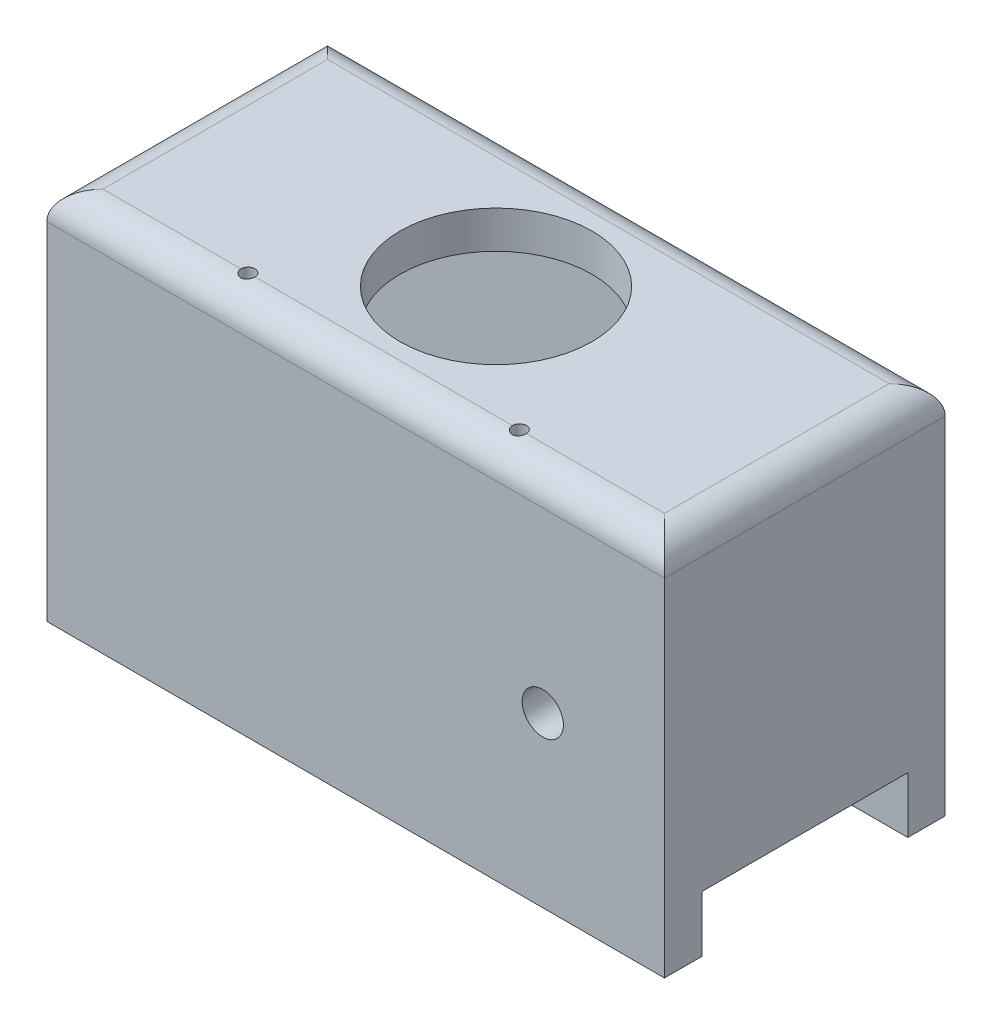
ISO-10303-21;
HEADER;
FILE_DESCRIPTION(('STEP AP214'),'2;1');
FILE_NAME('part.step','',(''),(''),'','','');
FILE_SCHEMA(('AUTOMOTIVE_DESIGN { 1 0 10303 214 1 1 1 1 }'));
ENDSEC;
DATA;
#1=APPLICATION_CONTEXT('core data for automotive mechanical design processes');
#2=APPLICATION_PROTOCOL_DEFINITION('international standard','automotive_design',2000,#1);
#3=PRODUCT_CONTEXT('',#1,'mechanical');
#4=PRODUCT('Part','Part','',(#3));
#5=PRODUCT_RELATED_PRODUCT_CATEGORY('part','',(#4));
#6=PRODUCT_DEFINITION_FORMATION('','',#4);
#7=PRODUCT_DEFINITION_CONTEXT('part definition',#1,'design');
#8=PRODUCT_DEFINITION('design','',#6,#7);
#9=PRODUCT_DEFINITION_SHAPE('','',#8);
#10=(LENGTH_UNIT() NAMED_UNIT(*) SI_UNIT(.MILLI.,.METRE.));
#11=(NAMED_UNIT(*) PLANE_ANGLE_UNIT() SI_UNIT($,.RADIAN.));
#12=(NAMED_UNIT(*) SI_UNIT($,.STERADIAN.) SOLID_ANGLE_UNIT());
#13=UNCERTAINTY_MEASURE_WITH_UNIT(LENGTH_MEASURE(1.E-05),#10,'distance_accuracy_value','');
#14=(GEOMETRIC_REPRESENTATION_CONTEXT(3) GLOBAL_UNCERTAINTY_ASSIGNED_CONTEXT((#13)) GLOBAL_UNIT_ASSIGNED_CONTEXT((#10,
#11,#12)) REPRESENTATION_CONTEXT('',''));
#15=CARTESIAN_POINT('',(0.,0.,0.));
#16=DIRECTION('',(0.,0.,1.));
#17=DIRECTION('',(1.,0.,0.));
#18=AXIS2_PLACEMENT_3D('',#15,#16,#17);
#19=CARTESIAN_POINT('',(0.,-30.,0.));
#20=DIRECTION('',(0.,-1.,0.));
#21=DIRECTION('',(0.,0.,-1.));
#22=AXIS2_PLACEMENT_3D('',#19,#20,#21);
#23=PLANE('',#22);
#24=DIRECTION('',(1.,0.,0.));
#25=VECTOR('',#24,1.);
#26=CARTESIAN_POINT('',(0.,-30.,26.));
#27=LINE('',#26,#25);
#28=CARTESIAN_POINT('',(-66.,-30.,26.));
#29=VERTEX_POINT('',#28);
#30=CARTESIAN_POINT('',(-62.,-30.,26.));
#31=VERTEX_POINT('',#30);
#32=EDGE_CURVE('E51',#29,#31,#27,.T.);
#33=ORIENTED_EDGE('',*,*,#32,.F.);
#34=DIRECTION('',(0.,0.,-1.));
#35=VECTOR('',#34,1.);
#36=CARTESIAN_POINT('',(-66.,-30.,30.));
#37=LINE('',#36,#35);
#38=CARTESIAN_POINT('',(-66.,-30.,4.));
#39=VERTEX_POINT('',#38);
#40=EDGE_CURVE('E439',#29,#39,#37,.T.);
#41=ORIENTED_EDGE('',*,*,#40,.T.);
#42=DIRECTION('',(-1.,0.,0.));
#43=VECTOR('',#42,1.);
#44=CARTESIAN_POINT('',(-66.,-30.,4.));
#45=LINE('',#44,#43);
#46=CARTESIAN_POINT('',(-62.,-30.,4.));
#47=VERTEX_POINT('',#46);
#48=EDGE_CURVE('E49',#47,#39,#45,.T.);
#49=ORIENTED_EDGE('',*,*,#48,.F.);
#50=DIRECTION('',(0.,0.,-1.));
#51=VECTOR('',#50,1.);
#52=CARTESIAN_POINT('',(-62.,-30.,26.));
#53=LINE('',#52,#51);
#54=EDGE_CURVE('E431',#31,#47,#53,.T.);
#55=ORIENTED_EDGE('',*,*,#54,.F.);
#56=EDGE_LOOP('',(#33,#41,#49,#55));
#57=FACE_BOUND('',#56,.T.);
#58=ADVANCED_FACE('F39',(#57),#23,.T.);
#59=CARTESIAN_POINT('',(0.,4.,0.));
#60=DIRECTION('',(-1.,0.,0.));
#61=DIRECTION('',(0.,0.,1.));
#62=AXIS2_PLACEMENT_3D('',#59,#60,#61);
#63=PLANE('',#62);
#64=DIRECTION('',(0.,-1.,0.));
#65=VECTOR('',#64,1.);
#66=CARTESIAN_POINT('',(0.,4.,0.));
#67=LINE('',#66,#65);
#68=CARTESIAN_POINT('',(0.,1.,0.));
#69=VERTEX_POINT('',#68);
#70=CARTESIAN_POINT('',(0.,-36.,0.));
#71=VERTEX_POINT('',#70);
#72=EDGE_CURVE('E445',#69,#71,#67,.T.);
#73=ORIENTED_EDGE('',*,*,#72,.F.);
#74=DIRECTION('',(0.,0.,-1.));
#75=VECTOR('',#74,1.);
#76=CARTESIAN_POINT('',(0.,1.,0.));
#77=LINE('',#76,#75);
#78=CARTESIAN_POINT('',(0.,1.,30.));
#79=VERTEX_POINT('',#78);
#80=EDGE_CURVE('E165',#69,#79,#77,.F.);
#81=ORIENTED_EDGE('',*,*,#80,.T.);
#82=DIRECTION('',(0.,-1.,0.));
#83=VECTOR('',#82,1.);
#84=CARTESIAN_POINT('',(0.,4.,30.));
#85=LINE('',#84,#83);
#86=CARTESIAN_POINT('',(0.,-36.,30.));
#87=VERTEX_POINT('',#86);
#88=EDGE_CURVE('E157',#79,#87,#85,.T.);
#89=ORIENTED_EDGE('',*,*,#88,.T.);
#90=DIRECTION('',(0.,0.,1.));
#91=VECTOR('',#90,1.);
#92=CARTESIAN_POINT('',(0.,-36.,30.));
#93=LINE('',#92,#91);
#94=CARTESIAN_POINT('',(0.,-36.,26.));
#95=VERTEX_POINT('',#94);
#96=EDGE_CURVE('E163',#95,#87,#93,.T.);
#97=ORIENTED_EDGE('',*,*,#96,.F.);
#98=DIRECTION('',(0.,1.,0.));
#99=VECTOR('',#98,1.);
#100=CARTESIAN_POINT('',(0.,-36.,26.));
#101=LINE('',#100,#99);
#102=CARTESIAN_POINT('',(0.,-30.,26.));
#103=VERTEX_POINT('',#102);
#104=EDGE_CURVE('E188',#95,#103,#101,.T.);
#105=ORIENTED_EDGE('',*,*,#104,.T.);
#106=DIRECTION('',(0.,0.,1.));
#107=VECTOR('',#106,1.);
#108=CARTESIAN_POINT('',(0.,-30.,0.));
#109=LINE('',#108,#107);
#110=CARTESIAN_POINT('',(0.,-30.,4.));
#111=VERTEX_POINT('',#110);
#112=EDGE_CURVE('E437',#111,#103,#109,.T.);
#113=ORIENTED_EDGE('',*,*,#112,.F.);
#114=DIRECTION('',(0.,1.,0.));
#115=VECTOR('',#114,1.);
#116=CARTESIAN_POINT('',(0.,-36.,4.));
#117=LINE('',#116,#115);
#118=CARTESIAN_POINT('',(0.,-36.,4.));
#119=VERTEX_POINT('',#118);
#120=EDGE_CURVE('E195',#119,#111,#117,.T.);
#121=ORIENTED_EDGE('',*,*,#120,.F.);
#122=DIRECTION('',(0.,0.,1.));
#123=VECTOR('',#122,1.);
#124=CARTESIAN_POINT('',(0.,-36.,0.));
#125=LINE('',#124,#123);
#126=EDGE_CURVE('E203',#71,#119,#125,.T.);
#127=ORIENTED_EDGE('',*,*,#126,.F.);
#128=EDGE_LOOP('',(#73,#81,#89,#97,#105,#113,#121,#127));
#129=FACE_BOUND('',#128,.T.);
#130=ADVANCED_FACE('F160',(#129),#63,.F.);
#131=CARTESIAN_POINT('',(0.,4.,0.));
#132=DIRECTION('',(0.,0.,1.));
#133=DIRECTION('',(1.,0.,0.));
#134=AXIS2_PLACEMENT_3D('',#131,#132,#133);
#135=PLANE('',#134);
#136=DIRECTION('',(0.,-1.,0.));
#137=VECTOR('',#136,1.);
#138=CARTESIAN_POINT('',(-66.,4.,0.));
#139=LINE('',#138,#137);
#140=CARTESIAN_POINT('',(-66.,1.,0.));
#141=VERTEX_POINT('',#140);
#142=CARTESIAN_POINT('',(-66.,-36.,0.));
#143=VERTEX_POINT('',#142);
#144=EDGE_CURVE('E443',#141,#143,#139,.T.);
#145=ORIENTED_EDGE('',*,*,#144,.F.);
#146=DIRECTION('',(-1.,0.,0.));
#147=VECTOR('',#146,1.);
#148=CARTESIAN_POINT('',(0.,1.,0.));
#149=LINE('',#148,#147);
#150=EDGE_CURVE('E459',#141,#69,#149,.F.);
#151=ORIENTED_EDGE('',*,*,#150,.T.);
#152=ORIENTED_EDGE('',*,*,#72,.T.);
#153=DIRECTION('',(1.,0.,0.));
#154=VECTOR('',#153,1.);
#155=CARTESIAN_POINT('',(-66.,-36.,0.));
#156=LINE('',#155,#154);
#157=EDGE_CURVE('E201',#143,#71,#156,.T.);
#158=ORIENTED_EDGE('',*,*,#157,.F.);
#159=EDGE_LOOP('',(#145,#151,#152,#158));
#160=FACE_BOUND('',#159,.T.);
#161=ADVANCED_FACE('F282',(#160),#135,.F.);
#162=CARTESIAN_POINT('',(-66.,4.,0.));
#163=DIRECTION('',(1.,0.,0.));
#164=DIRECTION('',(0.,0.,-1.));
#165=AXIS2_PLACEMENT_3D('',#162,#163,#164);
#166=PLANE('',#165);
#167=DIRECTION('',(0.,-1.,0.));
#168=VECTOR('',#167,1.);
#169=CARTESIAN_POINT('',(-66.,4.,30.));
#170=LINE('',#169,#168);
#171=CARTESIAN_POINT('',(-66.,1.,30.));
#172=VERTEX_POINT('',#171);
#173=CARTESIAN_POINT('',(-66.,-36.,30.));
#174=VERTEX_POINT('',#173);
#175=EDGE_CURVE('E168',#172,#174,#170,.T.);
#176=ORIENTED_EDGE('',*,*,#175,.F.);
#177=DIRECTION('',(0.,0.,1.));
#178=VECTOR('',#177,1.);
#179=CARTESIAN_POINT('',(-66.,1.,0.));
#180=LINE('',#179,#178);
#181=EDGE_CURVE('E465',#172,#141,#180,.F.);
#182=ORIENTED_EDGE('',*,*,#181,.T.);
#183=ORIENTED_EDGE('',*,*,#144,.T.);
#184=DIRECTION('',(0.,0.,-1.));
#185=VECTOR('',#184,1.);
#186=CARTESIAN_POINT('',(-66.,-36.,0.));
#187=LINE('',#186,#185);
#188=CARTESIAN_POINT('',(-66.,-36.,4.));
#189=VERTEX_POINT('',#188);
#190=EDGE_CURVE('E206',#189,#143,#187,.T.);
#191=ORIENTED_EDGE('',*,*,#190,.F.);
#192=DIRECTION('',(0.,1.,0.));
#193=VECTOR('',#192,1.);
#194=CARTESIAN_POINT('',(-66.,-36.,4.));
#195=LINE('',#194,#193);
#196=EDGE_CURVE('E198',#189,#39,#195,.T.);
#197=ORIENTED_EDGE('',*,*,#196,.T.);
#198=ORIENTED_EDGE('',*,*,#40,.F.);
#199=DIRECTION('',(0.,1.,0.));
#200=VECTOR('',#199,1.);
#201=CARTESIAN_POINT('',(-66.,-36.,26.));
#202=LINE('',#201,#200);
#203=CARTESIAN_POINT('',(-66.,-36.,26.));
#204=VERTEX_POINT('',#203);
#205=EDGE_CURVE('E191',#204,#29,#202,.T.);
#206=ORIENTED_EDGE('',*,*,#205,.F.);
#207=DIRECTION('',(0.,0.,-1.));
#208=VECTOR('',#207,1.);
#209=CARTESIAN_POINT('',(-66.,-36.,30.));
#210=LINE('',#209,#208);
#211=EDGE_CURVE('E177',#174,#204,#210,.T.);
#212=ORIENTED_EDGE('',*,*,#211,.F.);
#213=EDGE_LOOP('',(#176,#182,#183,#191,#197,#198,#206,#212));
#214=FACE_BOUND('',#213,.T.);
#215=ADVANCED_FACE('F278',(#214),#166,.F.);
#216=CARTESIAN_POINT('',(0.,4.,30.));
#217=DIRECTION('',(0.,0.,-1.));
#218=DIRECTION('',(-1.,0.,0.));
#219=AXIS2_PLACEMENT_3D('',#216,#217,#218);
#220=PLANE('',#219);
#221=CARTESIAN_POINT('',(-13.,-18.,30.));
#222=DIRECTION('',(0.,0.,1.));
#223=DIRECTION('',(1.,0.,0.));
#224=AXIS2_PLACEMENT_3D('',#221,#222,#223);
#225=CIRCLE('',#224,2.2);
#226=CARTESIAN_POINT('',(-10.8,-18.,30.));
#227=VERTEX_POINT('',#226);
#228=EDGE_CURVE('E185',#227,#227,#225,.T.);
#229=ORIENTED_EDGE('',*,*,#228,.F.);
#230=EDGE_LOOP('',(#229));
#231=FACE_BOUND('',#230,.T.);
#232=ORIENTED_EDGE('',*,*,#88,.F.);
#233=DIRECTION('',(1.,0.,0.));
#234=VECTOR('',#233,1.);
#235=CARTESIAN_POINT('',(0.,1.,30.));
#236=LINE('',#235,#234);
#237=EDGE_CURVE('E463',#79,#172,#236,.F.);
#238=ORIENTED_EDGE('',*,*,#237,.T.);
#239=ORIENTED_EDGE('',*,*,#175,.T.);
#240=DIRECTION('',(-1.,0.,0.));
#241=VECTOR('',#240,1.);
#242=CARTESIAN_POINT('',(0.,-36.,30.));
#243=LINE('',#242,#241);
#244=EDGE_CURVE('E172',#87,#174,#243,.T.);
#245=ORIENTED_EDGE('',*,*,#244,.F.);
#246=EDGE_LOOP('',(#232,#238,#239,#245));
#247=FACE_BOUND('',#246,.T.);
#248=ADVANCED_FACE('F173',(#231,#247),#220,.F.);
#249=CARTESIAN_POINT('',(0.,4.,0.));
#250=DIRECTION('',(0.,-1.,0.));
#251=DIRECTION('',(0.,0.,-1.));
#252=AXIS2_PLACEMENT_3D('',#249,#250,#251);
#253=PLANE('',#252);
#254=CARTESIAN_POINT('',(-33.,4.,15.));
#255=DIRECTION('',(0.,1.,0.));
#256=DIRECTION('',(0.,0.,1.));
#257=AXIS2_PLACEMENT_3D('',#254,#255,#256);
#258=CIRCLE('',#257,10.25);
#259=CARTESIAN_POINT('',(-33.,4.,25.25));
#260=VERTEX_POINT('',#259);
#261=EDGE_CURVE('E475',#260,#260,#258,.T.);
#262=ORIENTED_EDGE('',*,*,#261,.F.);
#263=EDGE_LOOP('',(#262));
#264=FACE_BOUND('',#263,.T.);
#265=DIRECTION('',(1.,0.,0.));
#266=VECTOR('',#265,1.);
#267=CARTESIAN_POINT('',(0.,4.,27.));
#268=LINE('',#267,#266);
#269=CARTESIAN_POINT('',(-63.,4.,27.));
#270=VERTEX_POINT('',#269);
#271=CARTESIAN_POINT('',(-48.25,4.,27.));
#272=VERTEX_POINT('',#271);
#273=EDGE_CURVE('E450',#270,#272,#268,.T.);
#274=ORIENTED_EDGE('',*,*,#273,.T.);
#275=CARTESIAN_POINT('',(-47.5,4.,27.));
#276=DIRECTION('',(0.,1.,0.));
#277=DIRECTION('',(0.,0.,1.));
#278=AXIS2_PLACEMENT_3D('',#275,#276,#277);
#279=CIRCLE('',#278,0.749999999999999);
#280=CARTESIAN_POINT('',(-46.75,4.,27.));
#281=VERTEX_POINT('',#280);
#282=EDGE_CURVE('E217',#281,#272,#279,.T.);
#283=ORIENTED_EDGE('',*,*,#282,.F.);
#284=CARTESIAN_POINT('',(-19.25,4.,27.));
#285=VERTEX_POINT('',#284);
#286=EDGE_CURVE('E454',#281,#285,#268,.T.);
#287=ORIENTED_EDGE('',*,*,#286,.T.);
#288=CARTESIAN_POINT('',(-18.5,4.,27.));
#289=DIRECTION('',(0.,1.,0.));
#290=DIRECTION('',(0.,0.,1.));
#291=AXIS2_PLACEMENT_3D('',#288,#289,#290);
#292=CIRCLE('',#291,0.750000000000002);
#293=CARTESIAN_POINT('',(-17.75,4.,27.));
#294=VERTEX_POINT('',#293);
#295=EDGE_CURVE('E219',#294,#285,#292,.T.);
#296=ORIENTED_EDGE('',*,*,#295,.F.);
#297=CARTESIAN_POINT('',(-3.,4.,27.));
#298=VERTEX_POINT('',#297);
#299=EDGE_CURVE('E449',#294,#298,#268,.T.);
#300=ORIENTED_EDGE('',*,*,#299,.T.);
#301=DIRECTION('',(0.,0.,-1.));
#302=VECTOR('',#301,1.);
#303=CARTESIAN_POINT('',(-3.,4.,0.));
#304=LINE('',#303,#302);
#305=CARTESIAN_POINT('',(-3.,4.,3.));
#306=VERTEX_POINT('',#305);
#307=EDGE_CURVE('E453',#298,#306,#304,.T.);
#308=ORIENTED_EDGE('',*,*,#307,.T.);
#309=DIRECTION('',(-1.,0.,0.));
#310=VECTOR('',#309,1.);
#311=CARTESIAN_POINT('',(0.,4.,3.));
#312=LINE('',#311,#310);
#313=CARTESIAN_POINT('',(-63.,4.,3.));
#314=VERTEX_POINT('',#313);
#315=EDGE_CURVE('E456',#306,#314,#312,.T.);
#316=ORIENTED_EDGE('',*,*,#315,.T.);
#317=DIRECTION('',(0.,0.,1.));
#318=VECTOR('',#317,1.);
#319=CARTESIAN_POINT('',(-63.,4.,0.));
#320=LINE('',#319,#318);
#321=EDGE_CURVE('E447',#314,#270,#320,.T.);
#322=ORIENTED_EDGE('',*,*,#321,.T.);
#323=EDGE_LOOP('',(#274,#283,#287,#296,#300,#308,#316,#322));
#324=FACE_BOUND('',#323,.T.);
#325=ADVANCED_FACE('F269',(#264,#324),#253,.F.);
#326=CARTESIAN_POINT('',(0.,1.,27.));
#327=DIRECTION('',(1.,0.,0.));
#328=DIRECTION('',(0.,0.,-1.));
#329=AXIS2_PLACEMENT_3D('',#326,#327,#328);
#330=CYLINDRICAL_SURFACE('',#329,3.);
#331=CARTESIAN_POINT('',(-48.25,4.,27.));
#332=CARTESIAN_POINT('',(-48.2500388301258,4.00003192731274,27.0415120473478));
#333=CARTESIAN_POINT('',(-48.2465561433151,3.99913939372562,27.0829997475334));
#334=CARTESIAN_POINT('',(-48.2328509287913,3.99574554488494,27.1646992316582));
#335=CARTESIAN_POINT('',(-48.2226415722282,3.99324737378243,27.2049133483873));
#336=CARTESIAN_POINT('',(-48.1957845824408,3.98688078165337,27.2830080012125));
#337=CARTESIAN_POINT('',(-48.1791371914211,3.98301241217538,27.3208886250346));
#338=CARTESIAN_POINT('',(-48.1399130283616,3.97432705177536,27.3933287911896));
#339=CARTESIAN_POINT('',(-48.1173348798418,3.96950984070002,27.4278875600006));
#340=CARTESIAN_POINT('',(-48.0664007685244,3.95933743015776,27.4933998508665));
#341=CARTESIAN_POINT('',(-48.0379463857457,3.95397398069205,27.5242755802635));
#342=CARTESIAN_POINT('',(-47.9762763114803,3.94336844452025,27.5808725186493));
#343=CARTESIAN_POINT('',(-47.9430597307436,3.93812638069343,27.6065927627932));
#344=CARTESIAN_POINT('',(-47.8722014810236,3.92827376315855,27.652513876802));
#345=CARTESIAN_POINT('',(-47.8345014434832,3.92367373901946,27.6726271467821));
#346=CARTESIAN_POINT('',(-47.7561236932034,3.91574729862185,27.7061991469347));
#347=CARTESIAN_POINT('',(-47.7154466114002,3.91242061342559,27.7196592824692));
#348=CARTESIAN_POINT('',(-47.6331287144295,3.90750241215809,27.7392773086339));
#349=CARTESIAN_POINT('',(-47.5915234953935,3.90587749208002,27.7455759922455));
#350=CARTESIAN_POINT('',(-47.5078166687809,3.90444680840472,27.7511309035566));
#351=CARTESIAN_POINT('',(-47.4657151315869,3.9046407898973,27.7503881180834));
#352=CARTESIAN_POINT('',(-47.3832919127991,3.90679603228222,27.7419932445186));
#353=CARTESIAN_POINT('',(-47.3429518265932,3.90871433240963,27.7345091053782));
#354=CARTESIAN_POINT('',(-47.2641191286051,3.914033578772,27.7131119658269));
#355=CARTESIAN_POINT('',(-47.225626632056,3.91743461735131,27.699198565001));
#356=CARTESIAN_POINT('',(-47.1511305526387,3.92537561658712,27.665194548646));
#357=CARTESIAN_POINT('',(-47.1151560696918,3.92992674497181,27.6450428988932));
#358=CARTESIAN_POINT('',(-47.0470398841643,3.93964867581531,27.5991774917251));
#359=CARTESIAN_POINT('',(-47.01489876348,3.94481957211537,27.5734628915283));
#360=CARTESIAN_POINT('',(-46.954401676273,3.95537879748456,27.5163351470019));
#361=CARTESIAN_POINT('',(-46.9261791881341,3.96076913024088,27.4847808618947));
#362=CARTESIAN_POINT('',(-46.8753944801316,3.97102871456993,27.4173135495995));
#363=CARTESIAN_POINT('',(-46.8528337162775,3.97589783191893,27.3813994047148));
#364=CARTESIAN_POINT('',(-46.813962349513,3.98459146976932,27.3060359047402));
#365=CARTESIAN_POINT('',(-46.797676870489,3.98841177403291,27.2665731035695));
#366=CARTESIAN_POINT('',(-46.7720288593788,3.99454248864177,27.1853763577002));
#367=CARTESIAN_POINT('',(-46.7626561876006,3.99685510987283,27.143645836216));
#368=CARTESIAN_POINT('',(-46.7545956773062,3.99885383359196,27.0846290879689));
#369=CARTESIAN_POINT('',(-46.7528719653829,3.9992830755228,27.0677378172055));
#370=CARTESIAN_POINT('',(-46.7505754353673,3.99985600288138,27.0339003679879));
#371=CARTESIAN_POINT('',(-46.7500007250107,4.00000015780813,27.0169543259228));
#372=CARTESIAN_POINT('',(-46.75,4.,27.));
#373=B_SPLINE_CURVE_WITH_KNOTS('',3,(#331,#332,#333,#334,#335,#336,#337,#338,#339,#340,#341,
#342,#343,#344,#345,#346,#347,#348,#349,#350,#351,#352,#353,#354,#355,#356,#357,#358,#359,#360,
#361,#362,#363,#364,#365,#366,#367,#368,#369,#370,#371,#372),.UNSPECIFIED.,.F.,.F.,(4,2,2,2,2,2,
2,2,2,2,2,2,2,2,2,2,2,2,2,2,4),(0.,0.124343430617164,0.24844411136095,0.37254012377865,
0.496664963345634,0.62306748518332,0.749493641109067,0.877796526915193,1.00607229931684,
1.13178005019344,1.25747018400481,1.38011302775202,1.50276351073685,1.62665408789803,
1.75056344751965,1.87799307541621,2.0054554405231,2.13342294242085,2.26120236650036,
2.31212245356339,2.36295861219684),.UNSPECIFIED.);
#374=EDGE_CURVE('E229',#272,#281,#373,.T.);
#375=ORIENTED_EDGE('',*,*,#374,.F.);
#376=ORIENTED_EDGE('',*,*,#273,.F.);
#377=CARTESIAN_POINT('',(-63.,1.,27.));
#378=DIRECTION('',(0.707106781186548,0.,0.707106781186547));
#379=DIRECTION('',(-0.707106781186547,0.,0.707106781186547));
#380=AXIS2_PLACEMENT_3D('',#377,#378,#379);
#381=ELLIPSE('',#380,4.24264068711929,3.);
#382=EDGE_CURVE('E470',#172,#270,#381,.F.);
#383=ORIENTED_EDGE('',*,*,#382,.F.);
#384=ORIENTED_EDGE('',*,*,#237,.F.);
#385=CARTESIAN_POINT('',(-3.,1.,27.));
#386=DIRECTION('',(0.707106781186547,0.,-0.707106781186548));
#387=DIRECTION('',(0.707106781186548,0.,0.707106781186547));
#388=AXIS2_PLACEMENT_3D('',#385,#386,#387);
#389=ELLIPSE('',#388,4.24264068711928,3.);
#390=EDGE_CURVE('E169',#298,#79,#389,.T.);
#391=ORIENTED_EDGE('',*,*,#390,.F.);
#392=ORIENTED_EDGE('',*,*,#299,.F.);
#393=CARTESIAN_POINT('',(-19.25,4.,27.));
#394=CARTESIAN_POINT('',(-19.2500388301258,4.00003192731274,27.0415120473478));
#395=CARTESIAN_POINT('',(-19.2465561433151,3.99913939372562,27.0829997475334));
#396=CARTESIAN_POINT('',(-19.2328509287913,3.99574554488494,27.1646992316582));
#397=CARTESIAN_POINT('',(-19.2226415722282,3.99324737378243,27.2049133483873));
#398=CARTESIAN_POINT('',(-19.1957845824408,3.98688078165337,27.2830080012125));
#399=CARTESIAN_POINT('',(-19.1791371914211,3.98301241217538,27.3208886250346));
#400=CARTESIAN_POINT('',(-19.1399130283616,3.97432705177536,27.3933287911896));
#401=CARTESIAN_POINT('',(-19.1173348798418,3.96950984070002,27.4278875600006));
#402=CARTESIAN_POINT('',(-19.0664007685244,3.95933743015776,27.4933998508665));
#403=CARTESIAN_POINT('',(-19.0379463857457,3.95397398069205,27.5242755802635));
#404=CARTESIAN_POINT('',(-18.9762763114803,3.94336844452025,27.5808725186493));
#405=CARTESIAN_POINT('',(-18.9430597307436,3.93812638069343,27.6065927627932));
#406=CARTESIAN_POINT('',(-18.8722014810236,3.92827376315855,27.652513876802));
#407=CARTESIAN_POINT('',(-18.8345014434832,3.92367373901946,27.6726271467821));
#408=CARTESIAN_POINT('',(-18.7561236932034,3.91574729862185,27.7061991469347));
#409=CARTESIAN_POINT('',(-18.7154466114002,3.91242061342559,27.7196592824692));
#410=CARTESIAN_POINT('',(-18.6331287144295,3.90750241215809,27.7392773086339));
#411=CARTESIAN_POINT('',(-18.5915234953935,3.90587749208002,27.7455759922455));
#412=CARTESIAN_POINT('',(-18.5078166687809,3.90444680840472,27.7511309035566));
#413=CARTESIAN_POINT('',(-18.4657151315868,3.9046407898973,27.7503881180834));
#414=CARTESIAN_POINT('',(-18.3832919127991,3.90679603228222,27.7419932445186));
#415=CARTESIAN_POINT('',(-18.3429518265932,3.90871433240963,27.7345091053782));
#416=CARTESIAN_POINT('',(-18.2641191286051,3.914033578772,27.7131119658269));
#417=CARTESIAN_POINT('',(-18.225626632056,3.91743461735131,27.699198565001));
#418=CARTESIAN_POINT('',(-18.1511305526387,3.92537561658712,27.665194548646));
#419=CARTESIAN_POINT('',(-18.1151560696918,3.92992674497181,27.6450428988932));
#420=CARTESIAN_POINT('',(-18.0470398841643,3.93964867581531,27.5991774917251));
#421=CARTESIAN_POINT('',(-18.01489876348,3.94481957211537,27.5734628915283));
#422=CARTESIAN_POINT('',(-17.954401676273,3.95537879748456,27.5163351470019));
#423=CARTESIAN_POINT('',(-17.9261791881341,3.96076913024088,27.4847808618947));
#424=CARTESIAN_POINT('',(-17.8753944801316,3.97102871456993,27.4173135495995));
#425=CARTESIAN_POINT('',(-17.8528337162775,3.97589783191893,27.3813994047148));
#426=CARTESIAN_POINT('',(-17.813962349513,3.98459146976932,27.3060359047402));
#427=CARTESIAN_POINT('',(-17.797676870489,3.98841177403291,27.2665731035695));
#428=CARTESIAN_POINT('',(-17.7720288593788,3.99454248864177,27.1853763577002));
#429=CARTESIAN_POINT('',(-17.7626561876006,3.99685510987283,27.1436458362159));
#430=CARTESIAN_POINT('',(-17.7545956773062,3.99885383359196,27.0846290879689));
#431=CARTESIAN_POINT('',(-17.7528719653829,3.9992830755228,27.0677378172055));
#432=CARTESIAN_POINT('',(-17.7505754353673,3.99985600288138,27.0339003679879));
#433=CARTESIAN_POINT('',(-17.7500007250107,4.00000015780813,27.0169543259228));
#434=CARTESIAN_POINT('',(-17.75,4.,27.));
#435=B_SPLINE_CURVE_WITH_KNOTS('',3,(#393,#394,#395,#396,#397,#398,#399,#400,#401,#402,#403,
#404,#405,#406,#407,#408,#409,#410,#411,#412,#413,#414,#415,#416,#417,#418,#419,#420,#421,#422,
#423,#424,#425,#426,#427,#428,#429,#430,#431,#432,#433,#434),.UNSPECIFIED.,.F.,.F.,(4,2,2,2,2,2,
2,2,2,2,2,2,2,2,2,2,2,2,2,2,4),(0.,0.124343430617164,0.24844411136095,0.372540123778651,
0.496664963345633,0.62306748518332,0.749493641109073,0.877796526915207,1.00607229931685,
1.13178005019345,1.25747018400481,1.38011302775203,1.50276351073687,1.62665408789804,
1.75056344751966,1.87799307541623,2.00545544052311,2.13342294242085,2.26120236650038,
2.3121224535634,2.36295861219684),.UNSPECIFIED.);
#436=EDGE_CURVE('E216',#285,#294,#435,.T.);
#437=ORIENTED_EDGE('',*,*,#436,.F.);
#438=ORIENTED_EDGE('',*,*,#286,.F.);
#439=EDGE_LOOP('',(#375,#376,#383,#384,#391,#392,#437,#438));
#440=FACE_BOUND('',#439,.T.);
#441=ADVANCED_FACE('F41',(#440),#330,.T.);
#442=CARTESIAN_POINT('',(-3.,1.,0.));
#443=DIRECTION('',(0.,0.,-1.));
#444=DIRECTION('',(-1.,0.,0.));
#445=AXIS2_PLACEMENT_3D('',#442,#443,#444);
#446=CYLINDRICAL_SURFACE('',#445,3.);
#447=ORIENTED_EDGE('',*,*,#390,.T.);
#448=ORIENTED_EDGE('',*,*,#80,.F.);
#449=CARTESIAN_POINT('',(-3.,1.,3.));
#450=DIRECTION('',(-0.707106781186548,0.,-0.707106781186547));
#451=DIRECTION('',(0.707106781186547,0.,-0.707106781186548));
#452=AXIS2_PLACEMENT_3D('',#449,#450,#451);
#453=ELLIPSE('',#452,4.24264068711928,3.);
#454=EDGE_CURVE('E468',#306,#69,#453,.T.);
#455=ORIENTED_EDGE('',*,*,#454,.F.);
#456=ORIENTED_EDGE('',*,*,#307,.F.);
#457=EDGE_LOOP('',(#447,#448,#455,#456));
#458=FACE_BOUND('',#457,.T.);
#459=ADVANCED_FACE('F294',(#458),#446,.T.);
#460=CARTESIAN_POINT('',(-63.,1.,0.));
#461=DIRECTION('',(0.,0.,1.));
#462=DIRECTION('',(1.,0.,0.));
#463=AXIS2_PLACEMENT_3D('',#460,#461,#462);
#464=CYLINDRICAL_SURFACE('',#463,3.);
#465=ORIENTED_EDGE('',*,*,#382,.T.);
#466=ORIENTED_EDGE('',*,*,#321,.F.);
#467=CARTESIAN_POINT('',(-63.,1.,3.));
#468=DIRECTION('',(-0.707106781186547,0.,0.707106781186547));
#469=DIRECTION('',(0.707106781186547,0.,0.707106781186547));
#470=AXIS2_PLACEMENT_3D('',#467,#468,#469);
#471=ELLIPSE('',#470,4.24264068711928,3.);
#472=EDGE_CURVE('E440',#141,#314,#471,.F.);
#473=ORIENTED_EDGE('',*,*,#472,.F.);
#474=ORIENTED_EDGE('',*,*,#181,.F.);
#475=EDGE_LOOP('',(#465,#466,#473,#474));
#476=FACE_BOUND('',#475,.T.);
#477=ADVANCED_FACE('F291',(#476),#464,.T.);
#478=CARTESIAN_POINT('',(0.,1.,3.));
#479=DIRECTION('',(-1.,0.,0.));
#480=DIRECTION('',(0.,0.,1.));
#481=AXIS2_PLACEMENT_3D('',#478,#479,#480);
#482=CYLINDRICAL_SURFACE('',#481,3.);
#483=ORIENTED_EDGE('',*,*,#454,.T.);
#484=ORIENTED_EDGE('',*,*,#150,.F.);
#485=ORIENTED_EDGE('',*,*,#472,.T.);
#486=ORIENTED_EDGE('',*,*,#315,.F.);
#487=EDGE_LOOP('',(#483,#484,#485,#486));
#488=FACE_BOUND('',#487,.T.);
#489=ADVANCED_FACE('F268',(#488),#482,.T.);
#490=CARTESIAN_POINT('',(-4.,-30.,26.));
#491=VERTEX_POINT('',#490);
#492=EDGE_CURVE('E11',#491,#103,#27,.T.);
#493=ORIENTED_EDGE('',*,*,#492,.F.);
#494=DIRECTION('',(0.,0.,1.));
#495=VECTOR('',#494,1.);
#496=CARTESIAN_POINT('',(-4.,-30.,4.));
#497=LINE('',#496,#495);
#498=CARTESIAN_POINT('',(-4.,-30.,4.));
#499=VERTEX_POINT('',#498);
#500=EDGE_CURVE('E422',#499,#491,#497,.T.);
#501=ORIENTED_EDGE('',*,*,#500,.F.);
#502=EDGE_CURVE('E65',#111,#499,#45,.T.);
#503=ORIENTED_EDGE('',*,*,#502,.F.);
#504=ORIENTED_EDGE('',*,*,#112,.T.);
#505=EDGE_LOOP('',(#493,#501,#503,#504));
#506=FACE_BOUND('',#505,.T.);
#507=ADVANCED_FACE('F264',(#506),#23,.T.);
#508=CARTESIAN_POINT('',(-62.,-30.,4.));
#509=DIRECTION('',(0.,0.,1.));
#510=DIRECTION('',(1.,0.,0.));
#511=AXIS2_PLACEMENT_3D('',#508,#509,#510);
#512=PLANE('',#511);
#513=DIRECTION('',(1.,0.,0.));
#514=VECTOR('',#513,1.);
#515=CARTESIAN_POINT('',(-62.,0.,4.));
#516=LINE('',#515,#514);
#517=CARTESIAN_POINT('',(-62.,0.,4.));
#518=VERTEX_POINT('',#517);
#519=CARTESIAN_POINT('',(-4.,0.,4.));
#520=VERTEX_POINT('',#519);
#521=EDGE_CURVE('E424',#518,#520,#516,.T.);
#522=ORIENTED_EDGE('',*,*,#521,.F.);
#523=DIRECTION('',(0.,1.,0.));
#524=VECTOR('',#523,1.);
#525=CARTESIAN_POINT('',(-62.,-30.,4.));
#526=LINE('',#525,#524);
#527=EDGE_CURVE('E428',#47,#518,#526,.T.);
#528=ORIENTED_EDGE('',*,*,#527,.F.);
#529=ORIENTED_EDGE('',*,*,#48,.T.);
#530=ORIENTED_EDGE('',*,*,#196,.F.);
#531=DIRECTION('',(-1.,0.,0.));
#532=VECTOR('',#531,1.);
#533=CARTESIAN_POINT('',(-66.,-36.,4.));
#534=LINE('',#533,#532);
#535=EDGE_CURVE('E209',#119,#189,#534,.T.);
#536=ORIENTED_EDGE('',*,*,#535,.F.);
#537=ORIENTED_EDGE('',*,*,#120,.T.);
#538=ORIENTED_EDGE('',*,*,#502,.T.);
#539=DIRECTION('',(0.,1.,0.));
#540=VECTOR('',#539,1.);
#541=CARTESIAN_POINT('',(-4.,-30.,4.));
#542=LINE('',#541,#540);
#543=EDGE_CURVE('E434',#499,#520,#542,.T.);
#544=ORIENTED_EDGE('',*,*,#543,.T.);
#545=EDGE_LOOP('',(#522,#528,#529,#530,#536,#537,#538,#544));
#546=FACE_BOUND('',#545,.T.);
#547=ADVANCED_FACE('F260',(#546),#512,.T.);
#548=CARTESIAN_POINT('',(-4.,-30.,4.));
#549=DIRECTION('',(-1.,0.,0.));
#550=DIRECTION('',(0.,0.,1.));
#551=AXIS2_PLACEMENT_3D('',#548,#549,#550);
#552=PLANE('',#551);
#553=DIRECTION('',(0.,0.,1.));
#554=VECTOR('',#553,1.);
#555=CARTESIAN_POINT('',(-4.,0.,4.));
#556=LINE('',#555,#554);
#557=CARTESIAN_POINT('',(-4.,0.,26.));
#558=VERTEX_POINT('',#557);
#559=EDGE_CURVE('E420',#520,#558,#556,.T.);
#560=ORIENTED_EDGE('',*,*,#559,.F.);
#561=ORIENTED_EDGE('',*,*,#543,.F.);
#562=ORIENTED_EDGE('',*,*,#500,.T.);
#563=DIRECTION('',(0.,1.,0.));
#564=VECTOR('',#563,1.);
#565=CARTESIAN_POINT('',(-4.,-30.,26.));
#566=LINE('',#565,#564);
#567=EDGE_CURVE('E415',#491,#558,#566,.T.);
#568=ORIENTED_EDGE('',*,*,#567,.T.);
#569=EDGE_LOOP('',(#560,#561,#562,#568));
#570=FACE_BOUND('',#569,.T.);
#571=ADVANCED_FACE('F256',(#570),#552,.T.);
#572=CARTESIAN_POINT('',(-4.,-30.,26.));
#573=DIRECTION('',(0.,0.,-1.));
#574=DIRECTION('',(-1.,0.,0.));
#575=AXIS2_PLACEMENT_3D('',#572,#573,#574);
#576=PLANE('',#575);
#577=CARTESIAN_POINT('',(-13.,-18.,26.));
#578=DIRECTION('',(0.,0.,-1.));
#579=DIRECTION('',(-1.,0.,0.));
#580=AXIS2_PLACEMENT_3D('',#577,#578,#579);
#581=CIRCLE('',#580,2.2);
#582=CARTESIAN_POINT('',(-15.2,-18.,26.));
#583=VERTEX_POINT('',#582);
#584=EDGE_CURVE('E44',#583,#583,#581,.T.);
#585=ORIENTED_EDGE('',*,*,#584,.F.);
#586=EDGE_LOOP('',(#585));
#587=FACE_BOUND('',#586,.T.);
#588=DIRECTION('',(-1.,0.,0.));
#589=VECTOR('',#588,1.);
#590=CARTESIAN_POINT('',(-4.,0.,26.));
#591=LINE('',#590,#589);
#592=CARTESIAN_POINT('',(-62.,0.,26.));
#593=VERTEX_POINT('',#592);
#594=EDGE_CURVE('E413',#558,#593,#591,.T.);
#595=ORIENTED_EDGE('',*,*,#594,.F.);
#596=ORIENTED_EDGE('',*,*,#567,.F.);
#597=ORIENTED_EDGE('',*,*,#492,.T.);
#598=ORIENTED_EDGE('',*,*,#104,.F.);
#599=DIRECTION('',(1.,0.,0.));
#600=VECTOR('',#599,1.);
#601=CARTESIAN_POINT('',(0.,-36.,26.));
#602=LINE('',#601,#600);
#603=EDGE_CURVE('E181',#204,#95,#602,.T.);
#604=ORIENTED_EDGE('',*,*,#603,.F.);
#605=ORIENTED_EDGE('',*,*,#205,.T.);
#606=ORIENTED_EDGE('',*,*,#32,.T.);
#607=DIRECTION('',(0.,1.,0.));
#608=VECTOR('',#607,1.);
#609=CARTESIAN_POINT('',(-62.,-30.,26.));
#610=LINE('',#609,#608);
#611=EDGE_CURVE('E416',#31,#593,#610,.T.);
#612=ORIENTED_EDGE('',*,*,#611,.T.);
#613=EDGE_LOOP('',(#595,#596,#597,#598,#604,#605,#606,#612));
#614=FACE_BOUND('',#613,.T.);
#615=ADVANCED_FACE('F252',(#587,#614),#576,.T.);
#616=CARTESIAN_POINT('',(-62.,-30.,26.));
#617=DIRECTION('',(1.,0.,0.));
#618=DIRECTION('',(0.,0.,-1.));
#619=AXIS2_PLACEMENT_3D('',#616,#617,#618);
#620=PLANE('',#619);
#621=DIRECTION('',(0.,0.,-1.));
#622=VECTOR('',#621,1.);
#623=CARTESIAN_POINT('',(-62.,0.,26.));
#624=LINE('',#623,#622);
#625=EDGE_CURVE('E419',#593,#518,#624,.T.);
#626=ORIENTED_EDGE('',*,*,#625,.F.);
#627=ORIENTED_EDGE('',*,*,#611,.F.);
#628=ORIENTED_EDGE('',*,*,#54,.T.);
#629=ORIENTED_EDGE('',*,*,#527,.T.);
#630=EDGE_LOOP('',(#626,#627,#628,#629));
#631=FACE_BOUND('',#630,.T.);
#632=ADVANCED_FACE('F249',(#631),#620,.T.);
#633=CARTESIAN_POINT('',(0.,0.,0.));
#634=DIRECTION('',(0.,-1.,0.));
#635=DIRECTION('',(0.,0.,-1.));
#636=AXIS2_PLACEMENT_3D('',#633,#634,#635);
#637=PLANE('',#636);
#638=CARTESIAN_POINT('',(-33.,0.,15.));
#639=DIRECTION('',(0.,-1.,0.));
#640=DIRECTION('',(0.,0.,-1.));
#641=AXIS2_PLACEMENT_3D('',#638,#639,#640);
#642=CIRCLE('',#641,10.25);
#643=CARTESIAN_POINT('',(-33.,0.,4.75));
#644=VERTEX_POINT('',#643);
#645=EDGE_CURVE('E473',#644,#644,#642,.T.);
#646=ORIENTED_EDGE('',*,*,#645,.F.);
#647=EDGE_LOOP('',(#646));
#648=FACE_BOUND('',#647,.T.);
#649=ORIENTED_EDGE('',*,*,#521,.T.);
#650=ORIENTED_EDGE('',*,*,#559,.T.);
#651=ORIENTED_EDGE('',*,*,#594,.T.);
#652=ORIENTED_EDGE('',*,*,#625,.T.);
#653=EDGE_LOOP('',(#649,#650,#651,#652));
#654=FACE_BOUND('',#653,.T.);
#655=ADVANCED_FACE('F247',(#648,#654),#637,.T.);
#656=CARTESIAN_POINT('',(-33.,-30.,15.));
#657=DIRECTION('',(0.,1.,0.));
#658=DIRECTION('',(0.,0.,1.));
#659=AXIS2_PLACEMENT_3D('',#656,#657,#658);
#660=CYLINDRICAL_SURFACE('',#659,10.25);
#661=ORIENTED_EDGE('',*,*,#645,.T.);
#662=EDGE_LOOP('',(#661));
#663=FACE_BOUND('',#662,.T.);
#664=ORIENTED_EDGE('',*,*,#261,.T.);
#665=EDGE_LOOP('',(#664));
#666=FACE_BOUND('',#665,.T.);
#667=ADVANCED_FACE('F241',(#663,#666),#660,.F.);
#668=CARTESIAN_POINT('',(-18.5,-30.,27.));
#669=DIRECTION('',(0.,1.,0.));
#670=DIRECTION('',(0.,0.,1.));
#671=AXIS2_PLACEMENT_3D('',#668,#669,#670);
#672=CYLINDRICAL_SURFACE('',#671,0.750000000000002);
#673=ORIENTED_EDGE('',*,*,#436,.T.);
#674=ORIENTED_EDGE('',*,*,#295,.T.);
#675=EDGE_LOOP('',(#673,#674));
#676=FACE_BOUND('',#675,.T.);
#677=CARTESIAN_POINT('',(-18.5,-30.,27.));
#678=DIRECTION('',(0.,1.,0.));
#679=DIRECTION('',(0.,0.,1.));
#680=AXIS2_PLACEMENT_3D('',#677,#678,#679);
#681=CIRCLE('',#680,0.750000000000002);
#682=CARTESIAN_POINT('',(-18.5,-30.,27.75));
#683=VERTEX_POINT('',#682);
#684=EDGE_CURVE('E194',#683,#683,#681,.T.);
#685=ORIENTED_EDGE('',*,*,#684,.F.);
#686=EDGE_LOOP('',(#685));
#687=FACE_BOUND('',#686,.T.);
#688=ADVANCED_FACE('F236',(#676,#687),#672,.F.);
#689=CARTESIAN_POINT('',(-47.5,-30.,27.));
#690=DIRECTION('',(0.,1.,0.));
#691=DIRECTION('',(0.,0.,1.));
#692=AXIS2_PLACEMENT_3D('',#689,#690,#691);
#693=CYLINDRICAL_SURFACE('',#692,0.749999999999999);
#694=ORIENTED_EDGE('',*,*,#374,.T.);
#695=ORIENTED_EDGE('',*,*,#282,.T.);
#696=EDGE_LOOP('',(#694,#695));
#697=FACE_BOUND('',#696,.T.);
#698=CARTESIAN_POINT('',(-47.5,-30.,27.));
#699=DIRECTION('',(0.,1.,0.));
#700=DIRECTION('',(0.,0.,1.));
#701=AXIS2_PLACEMENT_3D('',#698,#699,#700);
#702=CIRCLE('',#701,0.749999999999999);
#703=CARTESIAN_POINT('',(-47.5,-30.,27.75));
#704=VERTEX_POINT('',#703);
#705=EDGE_CURVE('E213',#704,#704,#702,.T.);
#706=ORIENTED_EDGE('',*,*,#705,.F.);
#707=EDGE_LOOP('',(#706));
#708=FACE_BOUND('',#707,.T.);
#709=ADVANCED_FACE('F240',(#697,#708),#693,.F.);
#710=CARTESIAN_POINT('',(0.,-36.,0.));
#711=DIRECTION('',(0.,1.,0.));
#712=DIRECTION('',(0.,0.,1.));
#713=AXIS2_PLACEMENT_3D('',#710,#711,#712);
#714=PLANE('',#713);
#715=ORIENTED_EDGE('',*,*,#126,.T.);
#716=ORIENTED_EDGE('',*,*,#535,.T.);
#717=ORIENTED_EDGE('',*,*,#190,.T.);
#718=ORIENTED_EDGE('',*,*,#157,.T.);
#719=EDGE_LOOP('',(#715,#716,#717,#718));
#720=FACE_BOUND('',#719,.T.);
#721=ADVANCED_FACE('F354',(#720),#714,.F.);
#722=CARTESIAN_POINT('',(0.,-36.,0.));
#723=DIRECTION('',(0.,1.,0.));
#724=DIRECTION('',(0.,0.,1.));
#725=AXIS2_PLACEMENT_3D('',#722,#723,#724);
#726=PLANE('',#725);
#727=ORIENTED_EDGE('',*,*,#96,.T.);
#728=ORIENTED_EDGE('',*,*,#244,.T.);
#729=ORIENTED_EDGE('',*,*,#211,.T.);
#730=ORIENTED_EDGE('',*,*,#603,.T.);
#731=EDGE_LOOP('',(#727,#728,#729,#730));
#732=FACE_BOUND('',#731,.T.);
#733=ADVANCED_FACE('F179',(#732),#726,.F.);
#734=CARTESIAN_POINT('',(0.,-30.,0.));
#735=DIRECTION('',(0.,1.,0.));
#736=DIRECTION('',(0.,0.,1.));
#737=AXIS2_PLACEMENT_3D('',#734,#735,#736);
#738=PLANE('',#737);
#739=ORIENTED_EDGE('',*,*,#684,.T.);
#740=EDGE_LOOP('',(#739));
#741=FACE_BOUND('',#740,.T.);
#742=ADVANCED_FACE('F364',(#741),#738,.T.);
#743=ORIENTED_EDGE('',*,*,#705,.T.);
#744=EDGE_LOOP('',(#743));
#745=FACE_BOUND('',#744,.T.);
#746=ADVANCED_FACE('F372',(#745),#738,.T.);
#747=CARTESIAN_POINT('',(-13.,-18.,24.));
#748=DIRECTION('',(0.,0.,1.));
#749=DIRECTION('',(1.,0.,0.));
#750=AXIS2_PLACEMENT_3D('',#747,#748,#749);
#751=CYLINDRICAL_SURFACE('',#750,2.2);
#752=ORIENTED_EDGE('',*,*,#584,.T.);
#753=EDGE_LOOP('',(#752));
#754=FACE_BOUND('',#753,.T.);
#755=ORIENTED_EDGE('',*,*,#228,.T.);
#756=EDGE_LOOP('',(#755));
#757=FACE_BOUND('',#756,.T.);
#758=ADVANCED_FACE('F380',(#754,#757),#751,.F.);
#759=CLOSED_SHELL('',(#58,#130,#161,#215,#248,#325,#441,#459,#477,#489,#507,#547,#571,#615,#632,
#655,#667,#688,#709,#721,#733,#742,#746,#758));
#760=MANIFOLD_SOLID_BREP('B2',#759);
#761=ADVANCED_BREP_SHAPE_REPRESENTATION('',(#18,#760),#14);
#762=SHAPE_DEFINITION_REPRESENTATION(#9,#761);
ENDSEC;
END-ISO-10303-21;
